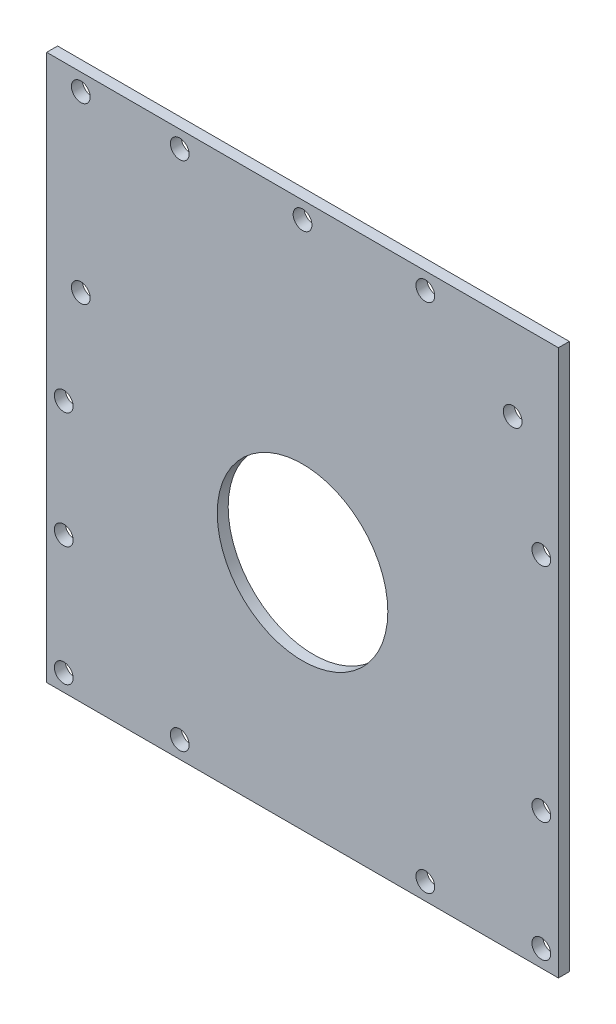
ISO-10303-21;
HEADER;
FILE_DESCRIPTION(('STEP AP214'),'2;1');
FILE_NAME('part.step','',(''),(''),'','','');
FILE_SCHEMA(('AUTOMOTIVE_DESIGN { 1 0 10303 214 1 1 1 1 }'));
ENDSEC;
DATA;
#1=APPLICATION_CONTEXT('core data for automotive mechanical design processes');
#2=APPLICATION_PROTOCOL_DEFINITION('international standard','automotive_design',2000,#1);
#3=PRODUCT_CONTEXT('',#1,'mechanical');
#4=PRODUCT('Part','Part','',(#3));
#5=PRODUCT_RELATED_PRODUCT_CATEGORY('part','',(#4));
#6=PRODUCT_DEFINITION_FORMATION('','',#4);
#7=PRODUCT_DEFINITION_CONTEXT('part definition',#1,'design');
#8=PRODUCT_DEFINITION('design','',#6,#7);
#9=PRODUCT_DEFINITION_SHAPE('','',#8);
#10=(LENGTH_UNIT() NAMED_UNIT(*) SI_UNIT(.MILLI.,.METRE.));
#11=(NAMED_UNIT(*) PLANE_ANGLE_UNIT() SI_UNIT($,.RADIAN.));
#12=(NAMED_UNIT(*) SI_UNIT($,.STERADIAN.) SOLID_ANGLE_UNIT());
#13=UNCERTAINTY_MEASURE_WITH_UNIT(LENGTH_MEASURE(1.E-05),#10,'distance_accuracy_value','');
#14=(GEOMETRIC_REPRESENTATION_CONTEXT(3) GLOBAL_UNCERTAINTY_ASSIGNED_CONTEXT((#13)) GLOBAL_UNIT_ASSIGNED_CONTEXT((#10,
#11,#12)) REPRESENTATION_CONTEXT('',''));
#15=CARTESIAN_POINT('',(0.,0.,0.));
#16=DIRECTION('',(0.,0.,1.));
#17=DIRECTION('',(1.,0.,0.));
#18=AXIS2_PLACEMENT_3D('',#15,#16,#17);
#19=CARTESIAN_POINT('',(75.,80.,3.2));
#20=DIRECTION('',(-1.,0.,0.));
#21=DIRECTION('',(0.,0.,1.));
#22=AXIS2_PLACEMENT_3D('',#19,#20,#21);
#23=PLANE('',#22);
#24=DIRECTION('',(0.,1.,0.));
#25=VECTOR('',#24,1.);
#26=CARTESIAN_POINT('',(75.,80.,0.));
#27=LINE('',#26,#25);
#28=CARTESIAN_POINT('',(75.,-80.,0.));
#29=VERTEX_POINT('',#28);
#30=CARTESIAN_POINT('',(75.,80.,0.));
#31=VERTEX_POINT('',#30);
#32=EDGE_CURVE('E96',#29,#31,#27,.T.);
#33=ORIENTED_EDGE('',*,*,#32,.T.);
#34=DIRECTION('',(0.,0.,-1.));
#35=VECTOR('',#34,1.);
#36=CARTESIAN_POINT('',(75.,80.,3.2));
#37=LINE('',#36,#35);
#38=CARTESIAN_POINT('',(75.,80.,3.2));
#39=VERTEX_POINT('',#38);
#40=EDGE_CURVE('E11',#39,#31,#37,.T.);
#41=ORIENTED_EDGE('',*,*,#40,.F.);
#42=DIRECTION('',(0.,1.,0.));
#43=VECTOR('',#42,1.);
#44=CARTESIAN_POINT('',(75.,80.,3.2));
#45=LINE('',#44,#43);
#46=CARTESIAN_POINT('',(75.,-80.,3.2));
#47=VERTEX_POINT('',#46);
#48=EDGE_CURVE('E84',#47,#39,#45,.T.);
#49=ORIENTED_EDGE('',*,*,#48,.F.);
#50=DIRECTION('',(0.,0.,-1.));
#51=VECTOR('',#50,1.);
#52=CARTESIAN_POINT('',(75.,-80.,3.2));
#53=LINE('',#52,#51);
#54=EDGE_CURVE('E92',#47,#29,#53,.T.);
#55=ORIENTED_EDGE('',*,*,#54,.T.);
#56=EDGE_LOOP('',(#33,#41,#49,#55));
#57=FACE_BOUND('',#56,.T.);
#58=ADVANCED_FACE('F33',(#57),#23,.F.);
#59=CARTESIAN_POINT('',(-75.,80.,3.2));
#60=DIRECTION('',(0.,-1.,0.));
#61=DIRECTION('',(0.,0.,-1.));
#62=AXIS2_PLACEMENT_3D('',#59,#60,#61);
#63=PLANE('',#62);
#64=DIRECTION('',(-1.,0.,0.));
#65=VECTOR('',#64,1.);
#66=CARTESIAN_POINT('',(-75.,80.,0.));
#67=LINE('',#66,#65);
#68=CARTESIAN_POINT('',(-75.,80.,0.));
#69=VERTEX_POINT('',#68);
#70=EDGE_CURVE('E88',#31,#69,#67,.T.);
#71=ORIENTED_EDGE('',*,*,#70,.T.);
#72=DIRECTION('',(0.,0.,-1.));
#73=VECTOR('',#72,1.);
#74=CARTESIAN_POINT('',(-75.,80.,3.2));
#75=LINE('',#74,#73);
#76=CARTESIAN_POINT('',(-75.,80.,3.2));
#77=VERTEX_POINT('',#76);
#78=EDGE_CURVE('E41',#77,#69,#75,.T.);
#79=ORIENTED_EDGE('',*,*,#78,.F.);
#80=DIRECTION('',(-1.,0.,0.));
#81=VECTOR('',#80,1.);
#82=CARTESIAN_POINT('',(-75.,80.,3.2));
#83=LINE('',#82,#81);
#84=EDGE_CURVE('E79',#39,#77,#83,.T.);
#85=ORIENTED_EDGE('',*,*,#84,.F.);
#86=ORIENTED_EDGE('',*,*,#40,.T.);
#87=EDGE_LOOP('',(#71,#79,#85,#86));
#88=FACE_BOUND('',#87,.T.);
#89=ADVANCED_FACE('F87',(#88),#63,.F.);
#90=CARTESIAN_POINT('',(-75.,80.,3.2));
#91=DIRECTION('',(1.,0.,0.));
#92=DIRECTION('',(0.,1.,0.));
#93=AXIS2_PLACEMENT_3D('',#90,#91,#92);
#94=PLANE('',#93);
#95=DIRECTION('',(0.,-1.,0.));
#96=VECTOR('',#95,1.);
#97=CARTESIAN_POINT('',(-75.,80.,0.));
#98=LINE('',#97,#96);
#99=CARTESIAN_POINT('',(-75.,-80.,0.));
#100=VERTEX_POINT('',#99);
#101=EDGE_CURVE('E66',#69,#100,#98,.T.);
#102=ORIENTED_EDGE('',*,*,#101,.T.);
#103=DIRECTION('',(0.,0.,-1.));
#104=VECTOR('',#103,1.);
#105=CARTESIAN_POINT('',(-75.,-80.,3.2));
#106=LINE('',#105,#104);
#107=CARTESIAN_POINT('',(-75.,-80.,3.2));
#108=VERTEX_POINT('',#107);
#109=EDGE_CURVE('E89',#108,#100,#106,.T.);
#110=ORIENTED_EDGE('',*,*,#109,.F.);
#111=DIRECTION('',(0.,-1.,0.));
#112=VECTOR('',#111,1.);
#113=CARTESIAN_POINT('',(-75.,80.,3.2));
#114=LINE('',#113,#112);
#115=EDGE_CURVE('E82',#77,#108,#114,.T.);
#116=ORIENTED_EDGE('',*,*,#115,.F.);
#117=ORIENTED_EDGE('',*,*,#78,.T.);
#118=EDGE_LOOP('',(#102,#110,#116,#117));
#119=FACE_BOUND('',#118,.T.);
#120=ADVANCED_FACE('F90',(#119),#94,.F.);
#121=CARTESIAN_POINT('',(-75.,-80.,3.2));
#122=DIRECTION('',(0.,1.,0.));
#123=DIRECTION('',(0.,0.,1.));
#124=AXIS2_PLACEMENT_3D('',#121,#122,#123);
#125=PLANE('',#124);
#126=DIRECTION('',(1.,0.,0.));
#127=VECTOR('',#126,1.);
#128=CARTESIAN_POINT('',(-75.,-80.,0.));
#129=LINE('',#128,#127);
#130=EDGE_CURVE('E72',#100,#29,#129,.T.);
#131=ORIENTED_EDGE('',*,*,#130,.T.);
#132=ORIENTED_EDGE('',*,*,#54,.F.);
#133=DIRECTION('',(1.,0.,0.));
#134=VECTOR('',#133,1.);
#135=CARTESIAN_POINT('',(-75.,-80.,3.2));
#136=LINE('',#135,#134);
#137=EDGE_CURVE('E49',#108,#47,#136,.T.);
#138=ORIENTED_EDGE('',*,*,#137,.F.);
#139=ORIENTED_EDGE('',*,*,#109,.T.);
#140=EDGE_LOOP('',(#131,#132,#138,#139));
#141=FACE_BOUND('',#140,.T.);
#142=ADVANCED_FACE('F104',(#141),#125,.F.);
#143=CARTESIAN_POINT('',(0.,0.,3.2));
#144=DIRECTION('',(0.,0.,1.));
#145=DIRECTION('',(1.,0.,0.));
#146=AXIS2_PLACEMENT_3D('',#143,#144,#145);
#147=PLANE('',#146);
#148=CARTESIAN_POINT('',(61.5927708694006,55.8758562366391,3.2));
#149=DIRECTION('',(0.,0.,1.));
#150=DIRECTION('',(1.,0.,0.));
#151=AXIS2_PLACEMENT_3D('',#148,#149,#150);
#152=CIRCLE('',#151,2.75);
#153=CARTESIAN_POINT('',(64.3427708694006,55.8758562366391,3.2));
#154=VERTEX_POINT('',#153);
#155=EDGE_CURVE('E194',#154,#154,#152,.F.);
#156=ORIENTED_EDGE('',*,*,#155,.T.);
#157=EDGE_LOOP('',(#156));
#158=FACE_BOUND('',#157,.T.);
#159=CARTESIAN_POINT('',(-70.,-5.99999999999999,3.2));
#160=DIRECTION('',(0.,0.,1.));
#161=DIRECTION('',(1.,0.,0.));
#162=AXIS2_PLACEMENT_3D('',#159,#160,#161);
#163=CIRCLE('',#162,2.75000000000002);
#164=CARTESIAN_POINT('',(-67.25,-5.99999999999999,3.2));
#165=VERTEX_POINT('',#164);
#166=EDGE_CURVE('E188',#165,#165,#163,.F.);
#167=ORIENTED_EDGE('',*,*,#166,.T.);
#168=EDGE_LOOP('',(#167));
#169=FACE_BOUND('',#168,.T.);
#170=CARTESIAN_POINT('',(0.,75.,3.2));
#171=DIRECTION('',(0.,0.,1.));
#172=DIRECTION('',(1.,0.,0.));
#173=AXIS2_PLACEMENT_3D('',#170,#171,#172);
#174=CIRCLE('',#173,2.75000000000001);
#175=CARTESIAN_POINT('',(2.75000000000002,75.,3.2));
#176=VERTEX_POINT('',#175);
#177=EDGE_CURVE('E182',#176,#176,#174,.F.);
#178=ORIENTED_EDGE('',*,*,#177,.T.);
#179=EDGE_LOOP('',(#178));
#180=FACE_BOUND('',#179,.T.);
#181=CARTESIAN_POINT('',(-70.,-40.,3.2));
#182=DIRECTION('',(0.,0.,1.));
#183=DIRECTION('',(1.,0.,0.));
#184=AXIS2_PLACEMENT_3D('',#181,#182,#183);
#185=CIRCLE('',#184,2.75000000000002);
#186=CARTESIAN_POINT('',(-67.25,-40.,3.2));
#187=VERTEX_POINT('',#186);
#188=EDGE_CURVE('E176',#187,#187,#185,.F.);
#189=ORIENTED_EDGE('',*,*,#188,.T.);
#190=EDGE_LOOP('',(#189));
#191=FACE_BOUND('',#190,.T.);
#192=CARTESIAN_POINT('',(-65.,75.,3.2));
#193=DIRECTION('',(0.,0.,1.));
#194=DIRECTION('',(1.,0.,0.));
#195=AXIS2_PLACEMENT_3D('',#192,#193,#194);
#196=CIRCLE('',#195,2.75000000000001);
#197=CARTESIAN_POINT('',(-62.25,75.,3.2));
#198=VERTEX_POINT('',#197);
#199=EDGE_CURVE('E170',#198,#198,#196,.F.);
#200=ORIENTED_EDGE('',*,*,#199,.T.);
#201=EDGE_LOOP('',(#200));
#202=FACE_BOUND('',#201,.T.);
#203=CARTESIAN_POINT('',(-36.,75.,3.2));
#204=DIRECTION('',(0.,0.,1.));
#205=DIRECTION('',(1.,0.,0.));
#206=AXIS2_PLACEMENT_3D('',#203,#204,#205);
#207=CIRCLE('',#206,2.75000000000001);
#208=CARTESIAN_POINT('',(-33.25,75.,3.2));
#209=VERTEX_POINT('',#208);
#210=EDGE_CURVE('E164',#209,#209,#207,.F.);
#211=ORIENTED_EDGE('',*,*,#210,.T.);
#212=EDGE_LOOP('',(#211));
#213=FACE_BOUND('',#212,.T.);
#214=CARTESIAN_POINT('',(36.,75.,3.2));
#215=DIRECTION('',(0.,0.,1.));
#216=DIRECTION('',(1.,0.,0.));
#217=AXIS2_PLACEMENT_3D('',#214,#215,#216);
#218=CIRCLE('',#217,2.75);
#219=CARTESIAN_POINT('',(38.75,75.,3.2));
#220=VERTEX_POINT('',#219);
#221=EDGE_CURVE('E158',#220,#220,#218,.F.);
#222=ORIENTED_EDGE('',*,*,#221,.T.);
#223=EDGE_LOOP('',(#222));
#224=FACE_BOUND('',#223,.T.);
#225=CARTESIAN_POINT('',(70.,25.,3.2));
#226=DIRECTION('',(0.,0.,1.));
#227=DIRECTION('',(1.,0.,0.));
#228=AXIS2_PLACEMENT_3D('',#225,#226,#227);
#229=CIRCLE('',#228,2.75000000000001);
#230=CARTESIAN_POINT('',(72.75,25.,3.2));
#231=VERTEX_POINT('',#230);
#232=EDGE_CURVE('E152',#231,#231,#229,.F.);
#233=ORIENTED_EDGE('',*,*,#232,.T.);
#234=EDGE_LOOP('',(#233));
#235=FACE_BOUND('',#234,.T.);
#236=CARTESIAN_POINT('',(70.,-40.,3.2));
#237=DIRECTION('',(0.,0.,1.));
#238=DIRECTION('',(1.,0.,0.));
#239=AXIS2_PLACEMENT_3D('',#236,#237,#238);
#240=CIRCLE('',#239,2.75000000000001);
#241=CARTESIAN_POINT('',(72.75,-40.,3.2));
#242=VERTEX_POINT('',#241);
#243=EDGE_CURVE('E146',#242,#242,#240,.F.);
#244=ORIENTED_EDGE('',*,*,#243,.T.);
#245=EDGE_LOOP('',(#244));
#246=FACE_BOUND('',#245,.T.);
#247=CARTESIAN_POINT('',(-70.,-75.,3.2));
#248=DIRECTION('',(0.,0.,1.));
#249=DIRECTION('',(1.,0.,0.));
#250=AXIS2_PLACEMENT_3D('',#247,#248,#249);
#251=CIRCLE('',#250,2.75000000000002);
#252=CARTESIAN_POINT('',(-67.25,-75.,3.2));
#253=VERTEX_POINT('',#252);
#254=EDGE_CURVE('E140',#253,#253,#251,.F.);
#255=ORIENTED_EDGE('',*,*,#254,.T.);
#256=EDGE_LOOP('',(#255));
#257=FACE_BOUND('',#256,.T.);
#258=CARTESIAN_POINT('',(36.,-75.,3.2));
#259=DIRECTION('',(0.,0.,1.));
#260=DIRECTION('',(1.,0.,0.));
#261=AXIS2_PLACEMENT_3D('',#258,#259,#260);
#262=CIRCLE('',#261,2.75);
#263=CARTESIAN_POINT('',(38.75,-75.,3.2));
#264=VERTEX_POINT('',#263);
#265=EDGE_CURVE('E134',#264,#264,#262,.F.);
#266=ORIENTED_EDGE('',*,*,#265,.T.);
#267=EDGE_LOOP('',(#266));
#268=FACE_BOUND('',#267,.T.);
#269=CARTESIAN_POINT('',(-36.,-75.,3.2));
#270=DIRECTION('',(0.,0.,1.));
#271=DIRECTION('',(1.,0.,0.));
#272=AXIS2_PLACEMENT_3D('',#269,#270,#271);
#273=CIRCLE('',#272,2.75);
#274=CARTESIAN_POINT('',(-33.25,-75.,3.2));
#275=VERTEX_POINT('',#274);
#276=EDGE_CURVE('E128',#275,#275,#273,.F.);
#277=ORIENTED_EDGE('',*,*,#276,.T.);
#278=EDGE_LOOP('',(#277));
#279=FACE_BOUND('',#278,.T.);
#280=CARTESIAN_POINT('',(70.,-75.,3.2));
#281=DIRECTION('',(0.,0.,1.));
#282=DIRECTION('',(1.,0.,0.));
#283=AXIS2_PLACEMENT_3D('',#280,#281,#282);
#284=CIRCLE('',#283,2.75000000000001);
#285=CARTESIAN_POINT('',(72.75,-75.,3.2));
#286=VERTEX_POINT('',#285);
#287=EDGE_CURVE('E122',#286,#286,#284,.F.);
#288=ORIENTED_EDGE('',*,*,#287,.T.);
#289=EDGE_LOOP('',(#288));
#290=FACE_BOUND('',#289,.T.);
#291=CARTESIAN_POINT('',(-65.,24.,3.2));
#292=DIRECTION('',(0.,0.,1.));
#293=DIRECTION('',(1.,0.,0.));
#294=AXIS2_PLACEMENT_3D('',#291,#292,#293);
#295=CIRCLE('',#294,2.75000000000001);
#296=CARTESIAN_POINT('',(-62.25,24.,3.2));
#297=VERTEX_POINT('',#296);
#298=EDGE_CURVE('E116',#297,#297,#295,.F.);
#299=ORIENTED_EDGE('',*,*,#298,.T.);
#300=EDGE_LOOP('',(#299));
#301=FACE_BOUND('',#300,.T.);
#302=CARTESIAN_POINT('',(0.,-12.,3.2));
#303=DIRECTION('',(0.,0.,1.));
#304=DIRECTION('',(-1.,0.,0.));
#305=AXIS2_PLACEMENT_3D('',#302,#303,#304);
#306=CIRCLE('',#305,25.);
#307=CARTESIAN_POINT('',(-25.,-12.,3.2));
#308=VERTEX_POINT('',#307);
#309=EDGE_CURVE('E112',#308,#308,#306,.T.);
#310=ORIENTED_EDGE('',*,*,#309,.F.);
#311=EDGE_LOOP('',(#310));
#312=FACE_BOUND('',#311,.T.);
#313=ORIENTED_EDGE('',*,*,#48,.T.);
#314=ORIENTED_EDGE('',*,*,#84,.T.);
#315=ORIENTED_EDGE('',*,*,#115,.T.);
#316=ORIENTED_EDGE('',*,*,#137,.T.);
#317=EDGE_LOOP('',(#313,#314,#315,#316));
#318=FACE_BOUND('',#317,.T.);
#319=ADVANCED_FACE('F80',(#158,#169,#180,#191,#202,#213,#224,#235,#246,#257,#268,#279,#290,#301,
#312,#318),#147,.T.);
#320=CARTESIAN_POINT('',(0.,0.,0.));
#321=DIRECTION('',(0.,0.,1.));
#322=DIRECTION('',(1.,0.,0.));
#323=AXIS2_PLACEMENT_3D('',#320,#321,#322);
#324=PLANE('',#323);
#325=CARTESIAN_POINT('',(61.5927708694006,55.8758562366391,0.));
#326=DIRECTION('',(0.,0.,-1.));
#327=DIRECTION('',(-1.,0.,0.));
#328=AXIS2_PLACEMENT_3D('',#325,#326,#327);
#329=CIRCLE('',#328,2.75);
#330=CARTESIAN_POINT('',(58.8427708694006,55.8758562366391,0.));
#331=VERTEX_POINT('',#330);
#332=EDGE_CURVE('E191',#331,#331,#329,.T.);
#333=ORIENTED_EDGE('',*,*,#332,.F.);
#334=EDGE_LOOP('',(#333));
#335=FACE_BOUND('',#334,.T.);
#336=CARTESIAN_POINT('',(-70.,-5.99999999999999,0.));
#337=DIRECTION('',(0.,0.,-1.));
#338=DIRECTION('',(-1.,0.,0.));
#339=AXIS2_PLACEMENT_3D('',#336,#337,#338);
#340=CIRCLE('',#339,2.75000000000002);
#341=CARTESIAN_POINT('',(-72.75,-5.99999999999999,0.));
#342=VERTEX_POINT('',#341);
#343=EDGE_CURVE('E185',#342,#342,#340,.T.);
#344=ORIENTED_EDGE('',*,*,#343,.F.);
#345=EDGE_LOOP('',(#344));
#346=FACE_BOUND('',#345,.T.);
#347=CARTESIAN_POINT('',(0.,75.,0.));
#348=DIRECTION('',(0.,0.,-1.));
#349=DIRECTION('',(-1.,0.,0.));
#350=AXIS2_PLACEMENT_3D('',#347,#348,#349);
#351=CIRCLE('',#350,2.75000000000001);
#352=CARTESIAN_POINT('',(-2.75,75.,0.));
#353=VERTEX_POINT('',#352);
#354=EDGE_CURVE('E179',#353,#353,#351,.T.);
#355=ORIENTED_EDGE('',*,*,#354,.F.);
#356=EDGE_LOOP('',(#355));
#357=FACE_BOUND('',#356,.T.);
#358=CARTESIAN_POINT('',(-70.,-40.,0.));
#359=DIRECTION('',(0.,0.,-1.));
#360=DIRECTION('',(-1.,0.,0.));
#361=AXIS2_PLACEMENT_3D('',#358,#359,#360);
#362=CIRCLE('',#361,2.75000000000002);
#363=CARTESIAN_POINT('',(-72.75,-40.,0.));
#364=VERTEX_POINT('',#363);
#365=EDGE_CURVE('E173',#364,#364,#362,.T.);
#366=ORIENTED_EDGE('',*,*,#365,.F.);
#367=EDGE_LOOP('',(#366));
#368=FACE_BOUND('',#367,.T.);
#369=CARTESIAN_POINT('',(-65.,75.,0.));
#370=DIRECTION('',(0.,0.,-1.));
#371=DIRECTION('',(-1.,0.,0.));
#372=AXIS2_PLACEMENT_3D('',#369,#370,#371);
#373=CIRCLE('',#372,2.75000000000001);
#374=CARTESIAN_POINT('',(-67.75,75.,0.));
#375=VERTEX_POINT('',#374);
#376=EDGE_CURVE('E167',#375,#375,#373,.T.);
#377=ORIENTED_EDGE('',*,*,#376,.F.);
#378=EDGE_LOOP('',(#377));
#379=FACE_BOUND('',#378,.T.);
#380=CARTESIAN_POINT('',(-36.,75.,0.));
#381=DIRECTION('',(0.,0.,-1.));
#382=DIRECTION('',(-1.,0.,0.));
#383=AXIS2_PLACEMENT_3D('',#380,#381,#382);
#384=CIRCLE('',#383,2.75000000000001);
#385=CARTESIAN_POINT('',(-38.75,75.,0.));
#386=VERTEX_POINT('',#385);
#387=EDGE_CURVE('E161',#386,#386,#384,.T.);
#388=ORIENTED_EDGE('',*,*,#387,.F.);
#389=EDGE_LOOP('',(#388));
#390=FACE_BOUND('',#389,.T.);
#391=CARTESIAN_POINT('',(36.,75.,0.));
#392=DIRECTION('',(0.,0.,-1.));
#393=DIRECTION('',(-1.,0.,0.));
#394=AXIS2_PLACEMENT_3D('',#391,#392,#393);
#395=CIRCLE('',#394,2.75);
#396=CARTESIAN_POINT('',(33.25,75.,0.));
#397=VERTEX_POINT('',#396);
#398=EDGE_CURVE('E155',#397,#397,#395,.T.);
#399=ORIENTED_EDGE('',*,*,#398,.F.);
#400=EDGE_LOOP('',(#399));
#401=FACE_BOUND('',#400,.T.);
#402=CARTESIAN_POINT('',(70.,25.,0.));
#403=DIRECTION('',(0.,0.,-1.));
#404=DIRECTION('',(-1.,0.,0.));
#405=AXIS2_PLACEMENT_3D('',#402,#403,#404);
#406=CIRCLE('',#405,2.75000000000001);
#407=CARTESIAN_POINT('',(67.25,25.,0.));
#408=VERTEX_POINT('',#407);
#409=EDGE_CURVE('E149',#408,#408,#406,.T.);
#410=ORIENTED_EDGE('',*,*,#409,.F.);
#411=EDGE_LOOP('',(#410));
#412=FACE_BOUND('',#411,.T.);
#413=CARTESIAN_POINT('',(70.,-40.,0.));
#414=DIRECTION('',(0.,0.,-1.));
#415=DIRECTION('',(-1.,0.,0.));
#416=AXIS2_PLACEMENT_3D('',#413,#414,#415);
#417=CIRCLE('',#416,2.75000000000001);
#418=CARTESIAN_POINT('',(67.25,-40.,0.));
#419=VERTEX_POINT('',#418);
#420=EDGE_CURVE('E143',#419,#419,#417,.T.);
#421=ORIENTED_EDGE('',*,*,#420,.F.);
#422=EDGE_LOOP('',(#421));
#423=FACE_BOUND('',#422,.T.);
#424=CARTESIAN_POINT('',(-70.,-75.,0.));
#425=DIRECTION('',(0.,0.,-1.));
#426=DIRECTION('',(-1.,0.,0.));
#427=AXIS2_PLACEMENT_3D('',#424,#425,#426);
#428=CIRCLE('',#427,2.75000000000002);
#429=CARTESIAN_POINT('',(-72.75,-75.,0.));
#430=VERTEX_POINT('',#429);
#431=EDGE_CURVE('E137',#430,#430,#428,.T.);
#432=ORIENTED_EDGE('',*,*,#431,.F.);
#433=EDGE_LOOP('',(#432));
#434=FACE_BOUND('',#433,.T.);
#435=CARTESIAN_POINT('',(36.,-75.,0.));
#436=DIRECTION('',(0.,0.,-1.));
#437=DIRECTION('',(-1.,0.,0.));
#438=AXIS2_PLACEMENT_3D('',#435,#436,#437);
#439=CIRCLE('',#438,2.75);
#440=CARTESIAN_POINT('',(33.25,-75.,0.));
#441=VERTEX_POINT('',#440);
#442=EDGE_CURVE('E131',#441,#441,#439,.T.);
#443=ORIENTED_EDGE('',*,*,#442,.F.);
#444=EDGE_LOOP('',(#443));
#445=FACE_BOUND('',#444,.T.);
#446=CARTESIAN_POINT('',(-36.,-75.,0.));
#447=DIRECTION('',(0.,0.,-1.));
#448=DIRECTION('',(-1.,0.,0.));
#449=AXIS2_PLACEMENT_3D('',#446,#447,#448);
#450=CIRCLE('',#449,2.75);
#451=CARTESIAN_POINT('',(-38.75,-75.,0.));
#452=VERTEX_POINT('',#451);
#453=EDGE_CURVE('E125',#452,#452,#450,.T.);
#454=ORIENTED_EDGE('',*,*,#453,.F.);
#455=EDGE_LOOP('',(#454));
#456=FACE_BOUND('',#455,.T.);
#457=CARTESIAN_POINT('',(70.,-75.,0.));
#458=DIRECTION('',(0.,0.,-1.));
#459=DIRECTION('',(-1.,0.,0.));
#460=AXIS2_PLACEMENT_3D('',#457,#458,#459);
#461=CIRCLE('',#460,2.75000000000001);
#462=CARTESIAN_POINT('',(67.25,-75.,0.));
#463=VERTEX_POINT('',#462);
#464=EDGE_CURVE('E119',#463,#463,#461,.T.);
#465=ORIENTED_EDGE('',*,*,#464,.F.);
#466=EDGE_LOOP('',(#465));
#467=FACE_BOUND('',#466,.T.);
#468=CARTESIAN_POINT('',(-65.,24.,0.));
#469=DIRECTION('',(0.,0.,-1.));
#470=DIRECTION('',(-1.,0.,0.));
#471=AXIS2_PLACEMENT_3D('',#468,#469,#470);
#472=CIRCLE('',#471,2.75000000000001);
#473=CARTESIAN_POINT('',(-67.75,24.,0.));
#474=VERTEX_POINT('',#473);
#475=EDGE_CURVE('E115',#474,#474,#472,.T.);
#476=ORIENTED_EDGE('',*,*,#475,.F.);
#477=EDGE_LOOP('',(#476));
#478=FACE_BOUND('',#477,.T.);
#479=CARTESIAN_POINT('',(0.,-12.,0.));
#480=DIRECTION('',(0.,0.,1.));
#481=DIRECTION('',(1.,0.,0.));
#482=AXIS2_PLACEMENT_3D('',#479,#480,#481);
#483=CIRCLE('',#482,25.);
#484=CARTESIAN_POINT('',(25.,-12.,0.));
#485=VERTEX_POINT('',#484);
#486=EDGE_CURVE('E99',#485,#485,#483,.F.);
#487=ORIENTED_EDGE('',*,*,#486,.F.);
#488=EDGE_LOOP('',(#487));
#489=FACE_BOUND('',#488,.T.);
#490=ORIENTED_EDGE('',*,*,#32,.F.);
#491=ORIENTED_EDGE('',*,*,#130,.F.);
#492=ORIENTED_EDGE('',*,*,#101,.F.);
#493=ORIENTED_EDGE('',*,*,#70,.F.);
#494=EDGE_LOOP('',(#490,#491,#492,#493));
#495=FACE_BOUND('',#494,.T.);
#496=ADVANCED_FACE('F107',(#335,#346,#357,#368,#379,#390,#401,#412,#423,#434,#445,#456,#467,
#478,#489,#495),#324,.F.);
#497=CARTESIAN_POINT('',(0.,-12.,-0.00100000000000013));
#498=DIRECTION('',(0.,0.,1.));
#499=DIRECTION('',(1.,0.,0.));
#500=AXIS2_PLACEMENT_3D('',#497,#498,#499);
#501=CYLINDRICAL_SURFACE('',#500,25.);
#502=ORIENTED_EDGE('',*,*,#309,.T.);
#503=EDGE_LOOP('',(#502));
#504=FACE_BOUND('',#503,.T.);
#505=ORIENTED_EDGE('',*,*,#486,.T.);
#506=EDGE_LOOP('',(#505));
#507=FACE_BOUND('',#506,.T.);
#508=ADVANCED_FACE('F204',(#504,#507),#501,.F.);
#509=CARTESIAN_POINT('',(-65.,24.,3.201));
#510=DIRECTION('',(0.,0.,-1.));
#511=DIRECTION('',(-1.,0.,0.));
#512=AXIS2_PLACEMENT_3D('',#509,#510,#511);
#513=CYLINDRICAL_SURFACE('',#512,2.75000000000001);
#514=ORIENTED_EDGE('',*,*,#298,.F.);
#515=EDGE_LOOP('',(#514));
#516=FACE_BOUND('',#515,.T.);
#517=ORIENTED_EDGE('',*,*,#475,.T.);
#518=EDGE_LOOP('',(#517));
#519=FACE_BOUND('',#518,.T.);
#520=ADVANCED_FACE('F235',(#516,#519),#513,.F.);
#521=CARTESIAN_POINT('',(70.,-75.,3.201));
#522=DIRECTION('',(0.,0.,-1.));
#523=DIRECTION('',(-1.,0.,0.));
#524=AXIS2_PLACEMENT_3D('',#521,#522,#523);
#525=CYLINDRICAL_SURFACE('',#524,2.75000000000001);
#526=ORIENTED_EDGE('',*,*,#287,.F.);
#527=EDGE_LOOP('',(#526));
#528=FACE_BOUND('',#527,.T.);
#529=ORIENTED_EDGE('',*,*,#464,.T.);
#530=EDGE_LOOP('',(#529));
#531=FACE_BOUND('',#530,.T.);
#532=ADVANCED_FACE('F241',(#528,#531),#525,.F.);
#533=CARTESIAN_POINT('',(-36.,-75.,3.201));
#534=DIRECTION('',(0.,0.,-1.));
#535=DIRECTION('',(-1.,0.,0.));
#536=AXIS2_PLACEMENT_3D('',#533,#534,#535);
#537=CYLINDRICAL_SURFACE('',#536,2.75);
#538=ORIENTED_EDGE('',*,*,#276,.F.);
#539=EDGE_LOOP('',(#538));
#540=FACE_BOUND('',#539,.T.);
#541=ORIENTED_EDGE('',*,*,#453,.T.);
#542=EDGE_LOOP('',(#541));
#543=FACE_BOUND('',#542,.T.);
#544=ADVANCED_FACE('F292',(#540,#543),#537,.F.);
#545=CARTESIAN_POINT('',(36.,-75.,3.201));
#546=DIRECTION('',(0.,0.,-1.));
#547=DIRECTION('',(-1.,0.,0.));
#548=AXIS2_PLACEMENT_3D('',#545,#546,#547);
#549=CYLINDRICAL_SURFACE('',#548,2.75);
#550=ORIENTED_EDGE('',*,*,#265,.F.);
#551=EDGE_LOOP('',(#550));
#552=FACE_BOUND('',#551,.T.);
#553=ORIENTED_EDGE('',*,*,#442,.T.);
#554=EDGE_LOOP('',(#553));
#555=FACE_BOUND('',#554,.T.);
#556=ADVANCED_FACE('F297',(#552,#555),#549,.F.);
#557=CARTESIAN_POINT('',(-70.,-75.,3.201));
#558=DIRECTION('',(0.,0.,-1.));
#559=DIRECTION('',(-1.,0.,0.));
#560=AXIS2_PLACEMENT_3D('',#557,#558,#559);
#561=CYLINDRICAL_SURFACE('',#560,2.75000000000002);
#562=ORIENTED_EDGE('',*,*,#254,.F.);
#563=EDGE_LOOP('',(#562));
#564=FACE_BOUND('',#563,.T.);
#565=ORIENTED_EDGE('',*,*,#431,.T.);
#566=EDGE_LOOP('',(#565));
#567=FACE_BOUND('',#566,.T.);
#568=ADVANCED_FACE('F303',(#564,#567),#561,.F.);
#569=CARTESIAN_POINT('',(70.,-40.,3.201));
#570=DIRECTION('',(0.,0.,-1.));
#571=DIRECTION('',(-1.,0.,0.));
#572=AXIS2_PLACEMENT_3D('',#569,#570,#571);
#573=CYLINDRICAL_SURFACE('',#572,2.75000000000001);
#574=ORIENTED_EDGE('',*,*,#243,.F.);
#575=EDGE_LOOP('',(#574));
#576=FACE_BOUND('',#575,.T.);
#577=ORIENTED_EDGE('',*,*,#420,.T.);
#578=EDGE_LOOP('',(#577));
#579=FACE_BOUND('',#578,.T.);
#580=ADVANCED_FACE('F307',(#576,#579),#573,.F.);
#581=CARTESIAN_POINT('',(70.,25.,3.201));
#582=DIRECTION('',(0.,0.,-1.));
#583=DIRECTION('',(-1.,0.,0.));
#584=AXIS2_PLACEMENT_3D('',#581,#582,#583);
#585=CYLINDRICAL_SURFACE('',#584,2.75000000000001);
#586=ORIENTED_EDGE('',*,*,#232,.F.);
#587=EDGE_LOOP('',(#586));
#588=FACE_BOUND('',#587,.T.);
#589=ORIENTED_EDGE('',*,*,#409,.T.);
#590=EDGE_LOOP('',(#589));
#591=FACE_BOUND('',#590,.T.);
#592=ADVANCED_FACE('F311',(#588,#591),#585,.F.);
#593=CARTESIAN_POINT('',(36.,75.,3.201));
#594=DIRECTION('',(0.,0.,-1.));
#595=DIRECTION('',(-1.,0.,0.));
#596=AXIS2_PLACEMENT_3D('',#593,#594,#595);
#597=CYLINDRICAL_SURFACE('',#596,2.75);
#598=ORIENTED_EDGE('',*,*,#221,.F.);
#599=EDGE_LOOP('',(#598));
#600=FACE_BOUND('',#599,.T.);
#601=ORIENTED_EDGE('',*,*,#398,.T.);
#602=EDGE_LOOP('',(#601));
#603=FACE_BOUND('',#602,.T.);
#604=ADVANCED_FACE('F315',(#600,#603),#597,.F.);
#605=CARTESIAN_POINT('',(-36.,75.,3.201));
#606=DIRECTION('',(0.,0.,-1.));
#607=DIRECTION('',(-1.,0.,0.));
#608=AXIS2_PLACEMENT_3D('',#605,#606,#607);
#609=CYLINDRICAL_SURFACE('',#608,2.75000000000001);
#610=ORIENTED_EDGE('',*,*,#210,.F.);
#611=EDGE_LOOP('',(#610));
#612=FACE_BOUND('',#611,.T.);
#613=ORIENTED_EDGE('',*,*,#387,.T.);
#614=EDGE_LOOP('',(#613));
#615=FACE_BOUND('',#614,.T.);
#616=ADVANCED_FACE('F319',(#612,#615),#609,.F.);
#617=CARTESIAN_POINT('',(-65.,75.,3.201));
#618=DIRECTION('',(0.,0.,-1.));
#619=DIRECTION('',(-1.,0.,0.));
#620=AXIS2_PLACEMENT_3D('',#617,#618,#619);
#621=CYLINDRICAL_SURFACE('',#620,2.75000000000001);
#622=ORIENTED_EDGE('',*,*,#199,.F.);
#623=EDGE_LOOP('',(#622));
#624=FACE_BOUND('',#623,.T.);
#625=ORIENTED_EDGE('',*,*,#376,.T.);
#626=EDGE_LOOP('',(#625));
#627=FACE_BOUND('',#626,.T.);
#628=ADVANCED_FACE('F323',(#624,#627),#621,.F.);
#629=CARTESIAN_POINT('',(-70.,-40.,3.201));
#630=DIRECTION('',(0.,0.,-1.));
#631=DIRECTION('',(-1.,0.,0.));
#632=AXIS2_PLACEMENT_3D('',#629,#630,#631);
#633=CYLINDRICAL_SURFACE('',#632,2.75000000000002);
#634=ORIENTED_EDGE('',*,*,#188,.F.);
#635=EDGE_LOOP('',(#634));
#636=FACE_BOUND('',#635,.T.);
#637=ORIENTED_EDGE('',*,*,#365,.T.);
#638=EDGE_LOOP('',(#637));
#639=FACE_BOUND('',#638,.T.);
#640=ADVANCED_FACE('F327',(#636,#639),#633,.F.);
#641=CARTESIAN_POINT('',(0.,75.,3.201));
#642=DIRECTION('',(0.,0.,-1.));
#643=DIRECTION('',(-1.,0.,0.));
#644=AXIS2_PLACEMENT_3D('',#641,#642,#643);
#645=CYLINDRICAL_SURFACE('',#644,2.75000000000001);
#646=ORIENTED_EDGE('',*,*,#177,.F.);
#647=EDGE_LOOP('',(#646));
#648=FACE_BOUND('',#647,.T.);
#649=ORIENTED_EDGE('',*,*,#354,.T.);
#650=EDGE_LOOP('',(#649));
#651=FACE_BOUND('',#650,.T.);
#652=ADVANCED_FACE('F331',(#648,#651),#645,.F.);
#653=CARTESIAN_POINT('',(-70.,-5.99999999999999,3.201));
#654=DIRECTION('',(0.,0.,-1.));
#655=DIRECTION('',(-1.,0.,0.));
#656=AXIS2_PLACEMENT_3D('',#653,#654,#655);
#657=CYLINDRICAL_SURFACE('',#656,2.75000000000002);
#658=ORIENTED_EDGE('',*,*,#166,.F.);
#659=EDGE_LOOP('',(#658));
#660=FACE_BOUND('',#659,.T.);
#661=ORIENTED_EDGE('',*,*,#343,.T.);
#662=EDGE_LOOP('',(#661));
#663=FACE_BOUND('',#662,.T.);
#664=ADVANCED_FACE('F335',(#660,#663),#657,.F.);
#665=CARTESIAN_POINT('',(61.5927708694006,55.8758562366391,3.201));
#666=DIRECTION('',(0.,0.,-1.));
#667=DIRECTION('',(-1.,0.,0.));
#668=AXIS2_PLACEMENT_3D('',#665,#666,#667);
#669=CYLINDRICAL_SURFACE('',#668,2.75);
#670=ORIENTED_EDGE('',*,*,#155,.F.);
#671=EDGE_LOOP('',(#670));
#672=FACE_BOUND('',#671,.T.);
#673=ORIENTED_EDGE('',*,*,#332,.T.);
#674=EDGE_LOOP('',(#673));
#675=FACE_BOUND('',#674,.T.);
#676=ADVANCED_FACE('F200',(#672,#675),#669,.F.);
#677=CLOSED_SHELL('',(#58,#89,#120,#142,#319,#496,#508,#520,#532,#544,#556,#568,#580,#592,#604,
#616,#628,#640,#652,#664,#676));
#678=MANIFOLD_SOLID_BREP('B2',#677);
#679=ADVANCED_BREP_SHAPE_REPRESENTATION('',(#18,#678),#14);
#680=SHAPE_DEFINITION_REPRESENTATION(#9,#679);
ENDSEC;
END-ISO-10303-21;
